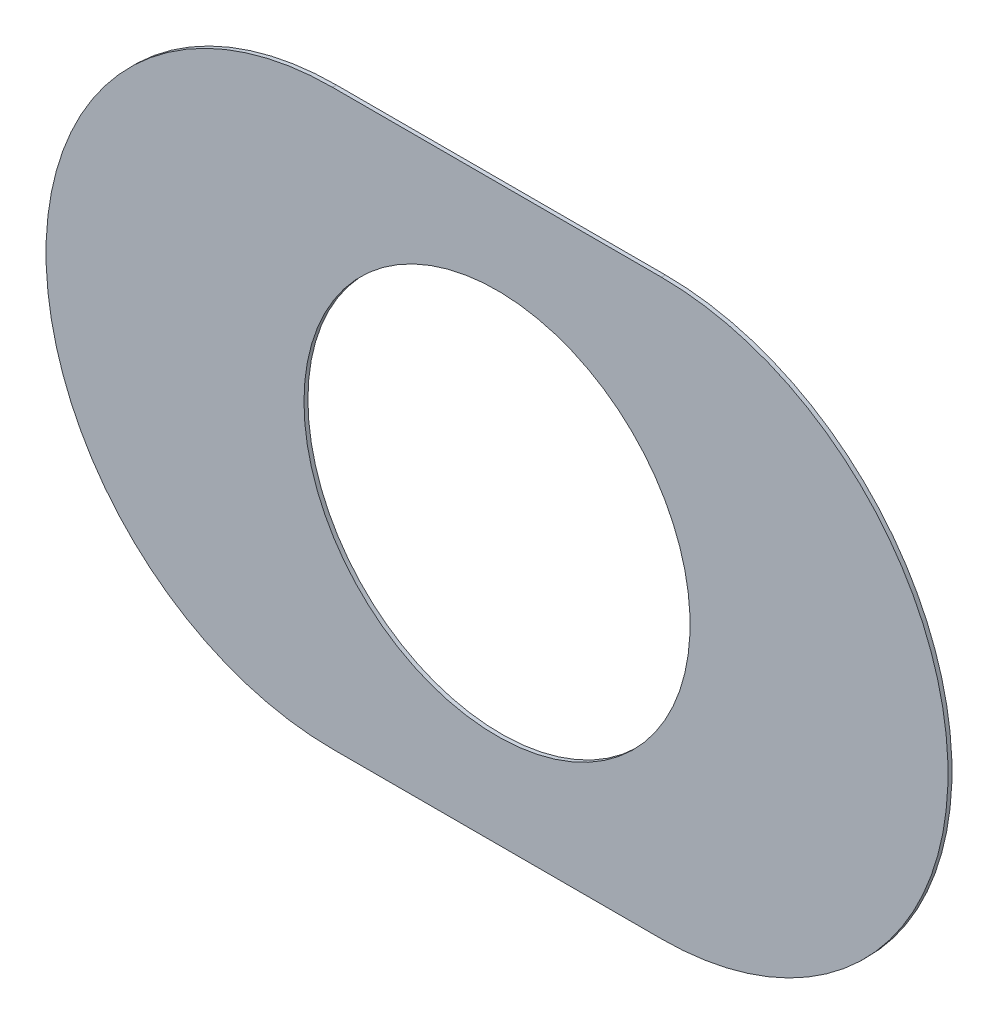
ISO-10303-21;
HEADER;
FILE_DESCRIPTION(('STEP AP214'),'2;1');
FILE_NAME('part.step','',(''),(''),'','','');
FILE_SCHEMA(('AUTOMOTIVE_DESIGN { 1 0 10303 214 1 1 1 1 }'));
ENDSEC;
DATA;
#1=APPLICATION_CONTEXT('core data for automotive mechanical design processes');
#2=APPLICATION_PROTOCOL_DEFINITION('international standard','automotive_design',2000,#1);
#3=PRODUCT_CONTEXT('',#1,'mechanical');
#4=PRODUCT('Part','Part','',(#3));
#5=PRODUCT_RELATED_PRODUCT_CATEGORY('part','',(#4));
#6=PRODUCT_DEFINITION_FORMATION('','',#4);
#7=PRODUCT_DEFINITION_CONTEXT('part definition',#1,'design');
#8=PRODUCT_DEFINITION('design','',#6,#7);
#9=PRODUCT_DEFINITION_SHAPE('','',#8);
#10=(LENGTH_UNIT() NAMED_UNIT(*) SI_UNIT(.MILLI.,.METRE.));
#11=(NAMED_UNIT(*) PLANE_ANGLE_UNIT() SI_UNIT($,.RADIAN.));
#12=(NAMED_UNIT(*) SI_UNIT($,.STERADIAN.) SOLID_ANGLE_UNIT());
#13=UNCERTAINTY_MEASURE_WITH_UNIT(LENGTH_MEASURE(1.E-05),#10,'distance_accuracy_value','');
#14=(GEOMETRIC_REPRESENTATION_CONTEXT(3) GLOBAL_UNCERTAINTY_ASSIGNED_CONTEXT((#13)) GLOBAL_UNIT_ASSIGNED_CONTEXT((#10,
#11,#12)) REPRESENTATION_CONTEXT('',''));
#15=CARTESIAN_POINT('',(0.,0.,0.));
#16=DIRECTION('',(0.,0.,1.));
#17=DIRECTION('',(1.,0.,0.));
#18=AXIS2_PLACEMENT_3D('',#15,#16,#17);
#19=CARTESIAN_POINT('',(1.54999965727325,34.8600006854535,0.));
#20=DIRECTION('',(0.,0.,-1.));
#21=DIRECTION('',(0.,-1.,0.));
#22=AXIS2_PLACEMENT_3D('',#19,#20,#21);
#23=PLANE('',#22);
#24=CARTESIAN_POINT('',(1.54999965727325,34.8600006854535,0.));
#25=DIRECTION('',(0.,0.,1.));
#26=DIRECTION('',(1.,0.,0.));
#27=AXIS2_PLACEMENT_3D('',#24,#25,#26);
#28=CIRCLE('',#27,0.49);
#29=CARTESIAN_POINT('',(1.05999965727325,34.8600006854535,0.));
#30=VERTEX_POINT('',#29);
#31=EDGE_CURVE('E82',#30,#30,#28,.T.);
#32=ORIENTED_EDGE('',*,*,#31,.F.);
#33=EDGE_LOOP('',(#32));
#34=FACE_BOUND('',#33,.T.);
#35=CARTESIAN_POINT('',(1.96740611181985,34.8600006854535,0.));
#36=DIRECTION('',(0.,0.,-1.));
#37=DIRECTION('',(0.,1.,0.));
#38=AXIS2_PLACEMENT_3D('',#35,#36,#37);
#39=CIRCLE('',#38,0.727257121659981);
#40=CARTESIAN_POINT('',(1.96740611181985,35.5872578071135,0.));
#41=VERTEX_POINT('',#40);
#42=CARTESIAN_POINT('',(1.96740611181985,34.1327435637935,0.));
#43=VERTEX_POINT('',#42);
#44=EDGE_CURVE('E28',#41,#43,#39,.T.);
#45=ORIENTED_EDGE('',*,*,#44,.F.);
#46=DIRECTION('',(1.,0.,0.));
#47=VECTOR('',#46,1.);
#48=CARTESIAN_POINT('',(1.13259320272665,35.5872578071135,0.));
#49=LINE('',#48,#47);
#50=CARTESIAN_POINT('',(1.13259320272665,35.5872578071135,0.));
#51=VERTEX_POINT('',#50);
#52=EDGE_CURVE('E89',#51,#41,#49,.T.);
#53=ORIENTED_EDGE('',*,*,#52,.F.);
#54=CARTESIAN_POINT('',(1.13259320272665,34.8600006854535,0.));
#55=DIRECTION('',(0.,0.,-1.));
#56=DIRECTION('',(0.,-1.,0.));
#57=AXIS2_PLACEMENT_3D('',#54,#55,#56);
#58=CIRCLE('',#57,0.727257121659981);
#59=CARTESIAN_POINT('',(1.13259320272665,34.1327435637935,0.));
#60=VERTEX_POINT('',#59);
#61=EDGE_CURVE('E21',#60,#51,#58,.T.);
#62=ORIENTED_EDGE('',*,*,#61,.F.);
#63=DIRECTION('',(-1.,0.,0.));
#64=VECTOR('',#63,1.);
#65=CARTESIAN_POINT('',(1.96740611181985,34.1327435637935,0.));
#66=LINE('',#65,#64);
#67=EDGE_CURVE('E107',#43,#60,#66,.T.);
#68=ORIENTED_EDGE('',*,*,#67,.F.);
#69=EDGE_LOOP('',(#45,#53,#62,#68));
#70=FACE_BOUND('',#69,.T.);
#71=ADVANCED_FACE('F17',(#34,#70),#23,.F.);
#72=CARTESIAN_POINT('',(1.54999965727325,34.8600006854535,-0.01));
#73=DIRECTION('',(0.,0.,-1.));
#74=DIRECTION('',(0.,-1.,0.));
#75=AXIS2_PLACEMENT_3D('',#72,#73,#74);
#76=PLANE('',#75);
#77=CARTESIAN_POINT('',(1.54999965727325,34.8600006854535,-0.01));
#78=DIRECTION('',(0.,0.,1.));
#79=DIRECTION('',(1.,0.,0.));
#80=AXIS2_PLACEMENT_3D('',#77,#78,#79);
#81=CIRCLE('',#80,0.49);
#82=CARTESIAN_POINT('',(1.05999965727325,34.8600006854535,-0.01));
#83=VERTEX_POINT('',#82);
#84=EDGE_CURVE('E99',#83,#83,#81,.T.);
#85=ORIENTED_EDGE('',*,*,#84,.T.);
#86=EDGE_LOOP('',(#85));
#87=FACE_BOUND('',#86,.T.);
#88=CARTESIAN_POINT('',(1.96740611181985,34.8600006854535,-0.01));
#89=DIRECTION('',(0.,0.,-1.));
#90=DIRECTION('',(0.,1.,0.));
#91=AXIS2_PLACEMENT_3D('',#88,#89,#90);
#92=CIRCLE('',#91,0.727257121659981);
#93=CARTESIAN_POINT('',(1.96740611181985,35.5872578071135,-0.01));
#94=VERTEX_POINT('',#93);
#95=CARTESIAN_POINT('',(1.96740611181985,34.1327435637935,-0.01));
#96=VERTEX_POINT('',#95);
#97=EDGE_CURVE('E11',#94,#96,#92,.T.);
#98=ORIENTED_EDGE('',*,*,#97,.T.);
#99=DIRECTION('',(-1.,0.,0.));
#100=VECTOR('',#99,1.);
#101=CARTESIAN_POINT('',(1.96740611181985,34.1327435637935,-0.01));
#102=LINE('',#101,#100);
#103=CARTESIAN_POINT('',(1.13259320272665,34.1327435637935,-0.01));
#104=VERTEX_POINT('',#103);
#105=EDGE_CURVE('E116',#96,#104,#102,.T.);
#106=ORIENTED_EDGE('',*,*,#105,.T.);
#107=CARTESIAN_POINT('',(1.13259320272665,34.8600006854535,-0.01));
#108=DIRECTION('',(0.,0.,-1.));
#109=DIRECTION('',(0.,-1.,0.));
#110=AXIS2_PLACEMENT_3D('',#107,#108,#109);
#111=CIRCLE('',#110,0.727257121659981);
#112=CARTESIAN_POINT('',(1.13259320272665,35.5872578071135,-0.01));
#113=VERTEX_POINT('',#112);
#114=EDGE_CURVE('E67',#104,#113,#111,.T.);
#115=ORIENTED_EDGE('',*,*,#114,.T.);
#116=DIRECTION('',(1.,0.,0.));
#117=VECTOR('',#116,1.);
#118=CARTESIAN_POINT('',(1.13259320272665,35.5872578071135,-0.01));
#119=LINE('',#118,#117);
#120=EDGE_CURVE('E112',#113,#94,#119,.T.);
#121=ORIENTED_EDGE('',*,*,#120,.T.);
#122=EDGE_LOOP('',(#98,#106,#115,#121));
#123=FACE_BOUND('',#122,.T.);
#124=ADVANCED_FACE('F142',(#87,#123),#76,.T.);
#125=CARTESIAN_POINT('',(1.96740611181985,34.8600006854535,0.));
#126=DIRECTION('',(0.,0.,-1.));
#127=DIRECTION('',(0.,1.,0.));
#128=AXIS2_PLACEMENT_3D('',#125,#126,#127);
#129=CYLINDRICAL_SURFACE('',#128,0.727257121659981);
#130=ORIENTED_EDGE('',*,*,#44,.T.);
#131=DIRECTION('',(0.,0.,-1.));
#132=VECTOR('',#131,1.);
#133=CARTESIAN_POINT('',(1.96740611181985,34.1327435637935,0.));
#134=LINE('',#133,#132);
#135=EDGE_CURVE('E103',#43,#96,#134,.T.);
#136=ORIENTED_EDGE('',*,*,#135,.T.);
#137=ORIENTED_EDGE('',*,*,#97,.F.);
#138=DIRECTION('',(0.,0.,-1.));
#139=VECTOR('',#138,1.);
#140=CARTESIAN_POINT('',(1.96740611181985,35.5872578071135,0.));
#141=LINE('',#140,#139);
#142=EDGE_CURVE('E96',#41,#94,#141,.T.);
#143=ORIENTED_EDGE('',*,*,#142,.F.);
#144=EDGE_LOOP('',(#130,#136,#137,#143));
#145=FACE_BOUND('',#144,.T.);
#146=ADVANCED_FACE('F140',(#145),#129,.T.);
#147=CARTESIAN_POINT('',(1.96740611181985,34.1327435637935,0.));
#148=DIRECTION('',(0.,-1.,0.));
#149=DIRECTION('',(0.,0.,-1.));
#150=AXIS2_PLACEMENT_3D('',#147,#148,#149);
#151=PLANE('',#150);
#152=ORIENTED_EDGE('',*,*,#67,.T.);
#153=DIRECTION('',(0.,0.,-1.));
#154=VECTOR('',#153,1.);
#155=CARTESIAN_POINT('',(1.13259320272665,34.1327435637935,0.));
#156=LINE('',#155,#154);
#157=EDGE_CURVE('E104',#60,#104,#156,.T.);
#158=ORIENTED_EDGE('',*,*,#157,.T.);
#159=ORIENTED_EDGE('',*,*,#105,.F.);
#160=ORIENTED_EDGE('',*,*,#135,.F.);
#161=EDGE_LOOP('',(#152,#158,#159,#160));
#162=FACE_BOUND('',#161,.T.);
#163=ADVANCED_FACE('F19',(#162),#151,.T.);
#164=CARTESIAN_POINT('',(1.13259320272665,34.8600006854535,0.));
#165=DIRECTION('',(0.,0.,-1.));
#166=DIRECTION('',(0.,-1.,0.));
#167=AXIS2_PLACEMENT_3D('',#164,#165,#166);
#168=CYLINDRICAL_SURFACE('',#167,0.727257121659981);
#169=ORIENTED_EDGE('',*,*,#61,.T.);
#170=DIRECTION('',(0.,0.,-1.));
#171=VECTOR('',#170,1.);
#172=CARTESIAN_POINT('',(1.13259320272665,35.5872578071135,0.));
#173=LINE('',#172,#171);
#174=EDGE_CURVE('E115',#51,#113,#173,.T.);
#175=ORIENTED_EDGE('',*,*,#174,.T.);
#176=ORIENTED_EDGE('',*,*,#114,.F.);
#177=ORIENTED_EDGE('',*,*,#157,.F.);
#178=EDGE_LOOP('',(#169,#175,#176,#177));
#179=FACE_BOUND('',#178,.T.);
#180=ADVANCED_FACE('F133',(#179),#168,.T.);
#181=CARTESIAN_POINT('',(1.13259320272665,35.5872578071135,0.));
#182=DIRECTION('',(0.,1.,0.));
#183=DIRECTION('',(1.,0.,0.));
#184=AXIS2_PLACEMENT_3D('',#181,#182,#183);
#185=PLANE('',#184);
#186=ORIENTED_EDGE('',*,*,#52,.T.);
#187=ORIENTED_EDGE('',*,*,#142,.T.);
#188=ORIENTED_EDGE('',*,*,#120,.F.);
#189=ORIENTED_EDGE('',*,*,#174,.F.);
#190=EDGE_LOOP('',(#186,#187,#188,#189));
#191=FACE_BOUND('',#190,.T.);
#192=ADVANCED_FACE('F138',(#191),#185,.T.);
#193=CARTESIAN_POINT('',(1.54999965727325,34.8600006854535,0.));
#194=DIRECTION('',(0.,0.,-1.));
#195=DIRECTION('',(1.,0.,0.));
#196=AXIS2_PLACEMENT_3D('',#193,#194,#195);
#197=CYLINDRICAL_SURFACE('',#196,0.49);
#198=ORIENTED_EDGE('',*,*,#84,.F.);
#199=DIRECTION('',(0.,0.,1.));
#200=VECTOR('',#199,1.);
#201=CARTESIAN_POINT('',(1.05999965727325,34.8600006854535,0.));
#202=LINE('',#201,#200);
#203=EDGE_CURVE('E85',#83,#30,#202,.T.);
#204=ORIENTED_EDGE('',*,*,#203,.T.);
#205=ORIENTED_EDGE('',*,*,#31,.T.);
#206=ORIENTED_EDGE('',*,*,#203,.F.);
#207=EDGE_LOOP('',(#198,#204,#205,#206));
#208=FACE_BOUND('',#207,.T.);
#209=ADVANCED_FACE('F84',(#208),#197,.F.);
#210=CLOSED_SHELL('',(#71,#124,#146,#163,#180,#192,#209));
#211=MANIFOLD_SOLID_BREP('B1',#210);
#212=ADVANCED_BREP_SHAPE_REPRESENTATION('',(#18,#211),#14);
#213=SHAPE_DEFINITION_REPRESENTATION(#9,#212);
ENDSEC;
END-ISO-10303-21;
